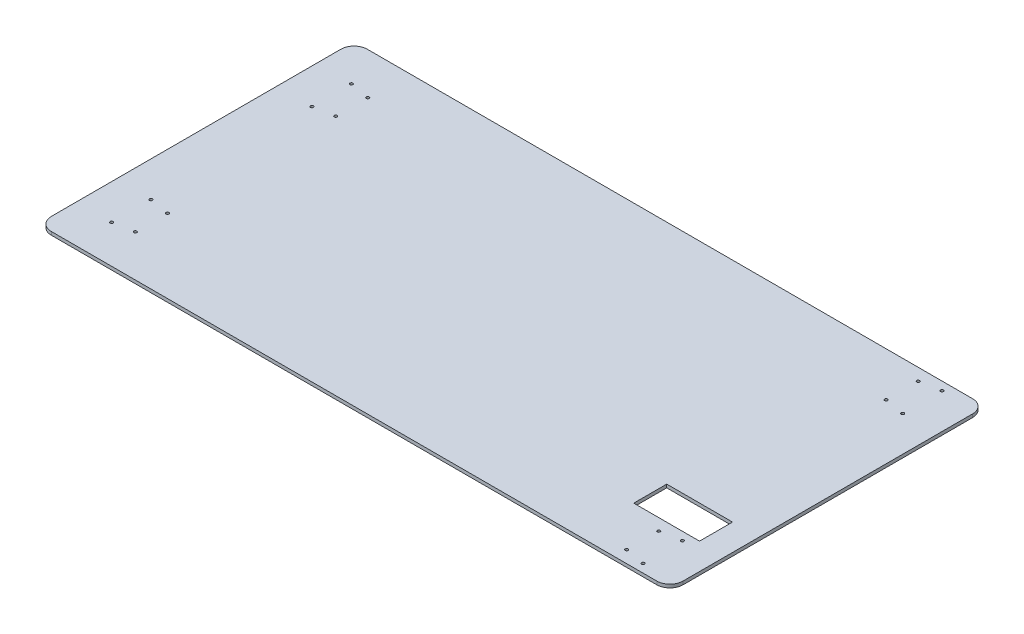
ISO-10303-21;
HEADER;
FILE_DESCRIPTION(('STEP AP214'),'2;1');
FILE_NAME('part.step','',(''),(''),'','','');
FILE_SCHEMA(('AUTOMOTIVE_DESIGN { 1 0 10303 214 1 1 1 1 }'));
ENDSEC;
DATA;
#1=APPLICATION_CONTEXT('core data for automotive mechanical design processes');
#2=APPLICATION_PROTOCOL_DEFINITION('international standard','automotive_design',2000,#1);
#3=PRODUCT_CONTEXT('',#1,'mechanical');
#4=PRODUCT('Part','Part','',(#3));
#5=PRODUCT_RELATED_PRODUCT_CATEGORY('part','',(#4));
#6=PRODUCT_DEFINITION_FORMATION('','',#4);
#7=PRODUCT_DEFINITION_CONTEXT('part definition',#1,'design');
#8=PRODUCT_DEFINITION('design','',#6,#7);
#9=PRODUCT_DEFINITION_SHAPE('','',#8);
#10=(LENGTH_UNIT() NAMED_UNIT(*) SI_UNIT(.MILLI.,.METRE.));
#11=(NAMED_UNIT(*) PLANE_ANGLE_UNIT() SI_UNIT($,.RADIAN.));
#12=(NAMED_UNIT(*) SI_UNIT($,.STERADIAN.) SOLID_ANGLE_UNIT());
#13=UNCERTAINTY_MEASURE_WITH_UNIT(LENGTH_MEASURE(1.E-05),#10,'distance_accuracy_value','');
#14=(GEOMETRIC_REPRESENTATION_CONTEXT(3) GLOBAL_UNCERTAINTY_ASSIGNED_CONTEXT((#13)) GLOBAL_UNIT_ASSIGNED_CONTEXT((#10,
#11,#12)) REPRESENTATION_CONTEXT('',''));
#15=CARTESIAN_POINT('',(0.,0.,0.));
#16=DIRECTION('',(0.,0.,1.));
#17=DIRECTION('',(1.,0.,0.));
#18=AXIS2_PLACEMENT_3D('',#15,#16,#17);
#19=CARTESIAN_POINT('',(0.,6.35,196.85));
#20=DIRECTION('',(0.,0.,1.));
#21=DIRECTION('',(1.,0.,0.));
#22=AXIS2_PLACEMENT_3D('',#19,#20,#21);
#23=PLANE('',#22);
#24=DIRECTION('',(-1.,0.,0.));
#25=VECTOR('',#24,1.);
#26=CARTESIAN_POINT('',(0.,0.,196.85));
#27=LINE('',#26,#25);
#28=CARTESIAN_POINT('',(558.8,0.,196.85));
#29=VERTEX_POINT('',#28);
#30=CARTESIAN_POINT('',(431.8,0.,196.85));
#31=VERTEX_POINT('',#30);
#32=EDGE_CURVE('E160',#29,#31,#27,.T.);
#33=ORIENTED_EDGE('',*,*,#32,.T.);
#34=DIRECTION('',(0.,-1.,0.));
#35=VECTOR('',#34,1.);
#36=CARTESIAN_POINT('',(431.8,6.35,196.85));
#37=LINE('',#36,#35);
#38=CARTESIAN_POINT('',(431.8,6.35,196.85));
#39=VERTEX_POINT('',#38);
#40=EDGE_CURVE('E139',#39,#31,#37,.T.);
#41=ORIENTED_EDGE('',*,*,#40,.F.);
#42=DIRECTION('',(-1.,0.,0.));
#43=VECTOR('',#42,1.);
#44=CARTESIAN_POINT('',(0.,6.35,196.85));
#45=LINE('',#44,#43);
#46=CARTESIAN_POINT('',(558.8,6.35,196.85));
#47=VERTEX_POINT('',#46);
#48=EDGE_CURVE('E147',#47,#39,#45,.T.);
#49=ORIENTED_EDGE('',*,*,#48,.F.);
#50=DIRECTION('',(0.,-1.,0.));
#51=VECTOR('',#50,1.);
#52=CARTESIAN_POINT('',(558.8,6.35,196.85));
#53=LINE('',#52,#51);
#54=EDGE_CURVE('E274',#47,#29,#53,.T.);
#55=ORIENTED_EDGE('',*,*,#54,.T.);
#56=EDGE_LOOP('',(#33,#41,#49,#55));
#57=FACE_BOUND('',#56,.T.);
#58=ADVANCED_FACE('F43',(#57),#23,.F.);
#59=CARTESIAN_POINT('',(431.8,6.35,0.));
#60=DIRECTION('',(-1.,0.,0.));
#61=DIRECTION('',(0.,0.,1.));
#62=AXIS2_PLACEMENT_3D('',#59,#60,#61);
#63=PLANE('',#62);
#64=DIRECTION('',(0.,0.,-1.));
#65=VECTOR('',#64,1.);
#66=CARTESIAN_POINT('',(431.8,0.,0.));
#67=LINE('',#66,#65);
#68=CARTESIAN_POINT('',(431.8,0.,133.155095102418));
#69=VERTEX_POINT('',#68);
#70=EDGE_CURVE('E246',#31,#69,#67,.T.);
#71=ORIENTED_EDGE('',*,*,#70,.T.);
#72=DIRECTION('',(0.,-1.,0.));
#73=VECTOR('',#72,1.);
#74=CARTESIAN_POINT('',(431.8,6.35,133.155095102418));
#75=LINE('',#74,#73);
#76=CARTESIAN_POINT('',(431.8,6.35,133.155095102418));
#77=VERTEX_POINT('',#76);
#78=EDGE_CURVE('E141',#77,#69,#75,.T.);
#79=ORIENTED_EDGE('',*,*,#78,.F.);
#80=DIRECTION('',(0.,0.,-1.));
#81=VECTOR('',#80,1.);
#82=CARTESIAN_POINT('',(431.8,6.35,0.));
#83=LINE('',#82,#81);
#84=EDGE_CURVE('E134',#39,#77,#83,.T.);
#85=ORIENTED_EDGE('',*,*,#84,.F.);
#86=ORIENTED_EDGE('',*,*,#40,.T.);
#87=EDGE_LOOP('',(#71,#79,#85,#86));
#88=FACE_BOUND('',#87,.T.);
#89=ADVANCED_FACE('F137',(#88),#63,.F.);
#90=CARTESIAN_POINT('',(0.,6.35,133.155095102418));
#91=DIRECTION('',(0.,0.,1.));
#92=DIRECTION('',(1.,0.,0.));
#93=AXIS2_PLACEMENT_3D('',#90,#91,#92);
#94=PLANE('',#93);
#95=DIRECTION('',(-1.,0.,0.));
#96=VECTOR('',#95,1.);
#97=CARTESIAN_POINT('',(0.,0.,133.155095102418));
#98=LINE('',#97,#96);
#99=CARTESIAN_POINT('',(558.8,0.,133.155095102418));
#100=VERTEX_POINT('',#99);
#101=EDGE_CURVE('E249',#100,#69,#98,.T.);
#102=ORIENTED_EDGE('',*,*,#101,.F.);
#103=DIRECTION('',(0.,-1.,0.));
#104=VECTOR('',#103,1.);
#105=CARTESIAN_POINT('',(558.8,6.35,133.155095102418));
#106=LINE('',#105,#104);
#107=CARTESIAN_POINT('',(558.8,6.35,133.155095102418));
#108=VERTEX_POINT('',#107);
#109=EDGE_CURVE('E168',#108,#100,#106,.T.);
#110=ORIENTED_EDGE('',*,*,#109,.F.);
#111=DIRECTION('',(-1.,0.,0.));
#112=VECTOR('',#111,1.);
#113=CARTESIAN_POINT('',(0.,6.35,133.155095102418));
#114=LINE('',#113,#112);
#115=EDGE_CURVE('E146',#108,#77,#114,.T.);
#116=ORIENTED_EDGE('',*,*,#115,.T.);
#117=ORIENTED_EDGE('',*,*,#78,.T.);
#118=EDGE_LOOP('',(#102,#110,#116,#117));
#119=FACE_BOUND('',#118,.T.);
#120=ADVANCED_FACE('F283',(#119),#94,.T.);
#121=CARTESIAN_POINT('',(609.6,6.35,0.));
#122=DIRECTION('',(1.,0.,0.));
#123=DIRECTION('',(0.,0.,-1.));
#124=AXIS2_PLACEMENT_3D('',#121,#122,#123);
#125=PLANE('',#124);
#126=DIRECTION('',(0.,0.,1.));
#127=VECTOR('',#126,1.);
#128=CARTESIAN_POINT('',(609.6,6.35,0.));
#129=LINE('',#128,#127);
#130=CARTESIAN_POINT('',(609.6,6.35,-279.4));
#131=VERTEX_POINT('',#130);
#132=CARTESIAN_POINT('',(609.6,6.35,279.4));
#133=VERTEX_POINT('',#132);
#134=EDGE_CURVE('E702',#131,#133,#129,.T.);
#135=ORIENTED_EDGE('',*,*,#134,.T.);
#136=DIRECTION('',(0.,-1.,0.));
#137=VECTOR('',#136,1.);
#138=CARTESIAN_POINT('',(609.6,0.,279.4));
#139=LINE('',#138,#137);
#140=CARTESIAN_POINT('',(609.6,0.,279.4));
#141=VERTEX_POINT('',#140);
#142=EDGE_CURVE('E166',#133,#141,#139,.T.);
#143=ORIENTED_EDGE('',*,*,#142,.T.);
#144=DIRECTION('',(0.,0.,1.));
#145=VECTOR('',#144,1.);
#146=CARTESIAN_POINT('',(609.6,0.,0.));
#147=LINE('',#146,#145);
#148=CARTESIAN_POINT('',(609.6,0.,-279.4));
#149=VERTEX_POINT('',#148);
#150=EDGE_CURVE('E231',#149,#141,#147,.T.);
#151=ORIENTED_EDGE('',*,*,#150,.F.);
#152=DIRECTION('',(0.,-1.,0.));
#153=VECTOR('',#152,1.);
#154=CARTESIAN_POINT('',(609.6,6.35,-279.4));
#155=LINE('',#154,#153);
#156=EDGE_CURVE('E162',#149,#131,#155,.F.);
#157=ORIENTED_EDGE('',*,*,#156,.T.);
#158=EDGE_LOOP('',(#135,#143,#151,#157));
#159=FACE_BOUND('',#158,.T.);
#160=ADVANCED_FACE('F332',(#159),#125,.T.);
#161=CARTESIAN_POINT('',(0.,6.35,-304.8));
#162=DIRECTION('',(0.,0.,-1.));
#163=DIRECTION('',(-1.,0.,0.));
#164=AXIS2_PLACEMENT_3D('',#161,#162,#163);
#165=PLANE('',#164);
#166=DIRECTION('',(1.,0.,0.));
#167=VECTOR('',#166,1.);
#168=CARTESIAN_POINT('',(0.,6.35,-304.8));
#169=LINE('',#168,#167);
#170=CARTESIAN_POINT('',(-584.2,6.35,-304.8));
#171=VERTEX_POINT('',#170);
#172=CARTESIAN_POINT('',(584.2,6.35,-304.8));
#173=VERTEX_POINT('',#172);
#174=EDGE_CURVE('E220',#171,#173,#169,.T.);
#175=ORIENTED_EDGE('',*,*,#174,.T.);
#176=DIRECTION('',(0.,-1.,0.));
#177=VECTOR('',#176,1.);
#178=CARTESIAN_POINT('',(584.2,6.35,-304.8));
#179=LINE('',#178,#177);
#180=CARTESIAN_POINT('',(584.2,0.,-304.8));
#181=VERTEX_POINT('',#180);
#182=EDGE_CURVE('E208',#173,#181,#179,.T.);
#183=ORIENTED_EDGE('',*,*,#182,.T.);
#184=DIRECTION('',(1.,0.,0.));
#185=VECTOR('',#184,1.);
#186=CARTESIAN_POINT('',(0.,0.,-304.8));
#187=LINE('',#186,#185);
#188=CARTESIAN_POINT('',(-584.2,0.,-304.8));
#189=VERTEX_POINT('',#188);
#190=EDGE_CURVE('E218',#189,#181,#187,.T.);
#191=ORIENTED_EDGE('',*,*,#190,.F.);
#192=DIRECTION('',(0.,-1.,0.));
#193=VECTOR('',#192,1.);
#194=CARTESIAN_POINT('',(-584.2,6.35,-304.8));
#195=LINE('',#194,#193);
#196=EDGE_CURVE('E205',#189,#171,#195,.F.);
#197=ORIENTED_EDGE('',*,*,#196,.T.);
#198=EDGE_LOOP('',(#175,#183,#191,#197));
#199=FACE_BOUND('',#198,.T.);
#200=ADVANCED_FACE('F217',(#199),#165,.T.);
#201=CARTESIAN_POINT('',(-609.6,6.35,0.));
#202=DIRECTION('',(1.,0.,0.));
#203=DIRECTION('',(0.,0.,-1.));
#204=AXIS2_PLACEMENT_3D('',#201,#202,#203);
#205=PLANE('',#204);
#206=DIRECTION('',(0.,0.,1.));
#207=VECTOR('',#206,1.);
#208=CARTESIAN_POINT('',(-609.6,6.35,0.));
#209=LINE('',#208,#207);
#210=CARTESIAN_POINT('',(-609.6,6.35,-279.4));
#211=VERTEX_POINT('',#210);
#212=CARTESIAN_POINT('',(-609.6,6.35,279.4));
#213=VERTEX_POINT('',#212);
#214=EDGE_CURVE('E391',#211,#213,#209,.T.);
#215=ORIENTED_EDGE('',*,*,#214,.F.);
#216=DIRECTION('',(0.,-1.,0.));
#217=VECTOR('',#216,1.);
#218=CARTESIAN_POINT('',(-609.6,0.,-279.4));
#219=LINE('',#218,#217);
#220=CARTESIAN_POINT('',(-609.6,0.,-279.4));
#221=VERTEX_POINT('',#220);
#222=EDGE_CURVE('E11',#211,#221,#219,.T.);
#223=ORIENTED_EDGE('',*,*,#222,.T.);
#224=DIRECTION('',(0.,0.,1.));
#225=VECTOR('',#224,1.);
#226=CARTESIAN_POINT('',(-609.6,0.,0.));
#227=LINE('',#226,#225);
#228=CARTESIAN_POINT('',(-609.6,0.,279.4));
#229=VERTEX_POINT('',#228);
#230=EDGE_CURVE('E230',#221,#229,#227,.T.);
#231=ORIENTED_EDGE('',*,*,#230,.T.);
#232=DIRECTION('',(0.,-1.,0.));
#233=VECTOR('',#232,1.);
#234=CARTESIAN_POINT('',(-609.6,6.35,279.4));
#235=LINE('',#234,#233);
#236=EDGE_CURVE('E52',#229,#213,#235,.F.);
#237=ORIENTED_EDGE('',*,*,#236,.T.);
#238=EDGE_LOOP('',(#215,#223,#231,#237));
#239=FACE_BOUND('',#238,.T.);
#240=ADVANCED_FACE('F326',(#239),#205,.F.);
#241=CARTESIAN_POINT('',(-541.528,6.35,231.394));
#242=DIRECTION('',(0.,-1.,0.));
#243=DIRECTION('',(0.,0.,-1.));
#244=AXIS2_PLACEMENT_3D('',#241,#242,#243);
#245=CYLINDRICAL_SURFACE('',#244,2.7940000000001);
#246=CARTESIAN_POINT('',(-541.528,6.35,231.394));
#247=DIRECTION('',(0.,1.,0.));
#248=DIRECTION('',(0.,0.,1.));
#249=AXIS2_PLACEMENT_3D('',#246,#247,#248);
#250=CIRCLE('',#249,2.7940000000001);
#251=CARTESIAN_POINT('',(-541.528,6.35,234.188));
#252=VERTEX_POINT('',#251);
#253=EDGE_CURVE('E417',#252,#252,#250,.F.);
#254=ORIENTED_EDGE('',*,*,#253,.F.);
#255=EDGE_LOOP('',(#254));
#256=FACE_BOUND('',#255,.T.);
#257=CARTESIAN_POINT('',(-541.528,0.,231.394));
#258=DIRECTION('',(0.,1.,0.));
#259=DIRECTION('',(0.,0.,1.));
#260=AXIS2_PLACEMENT_3D('',#257,#258,#259);
#261=CIRCLE('',#260,2.7940000000001);
#262=CARTESIAN_POINT('',(-541.528,0.,234.188));
#263=VERTEX_POINT('',#262);
#264=EDGE_CURVE('E265',#263,#263,#261,.F.);
#265=ORIENTED_EDGE('',*,*,#264,.T.);
#266=EDGE_LOOP('',(#265));
#267=FACE_BOUND('',#266,.T.);
#268=ADVANCED_FACE('F329',(#256,#267),#245,.F.);
#269=CARTESIAN_POINT('',(541.528,6.35,288.544));
#270=DIRECTION('',(0.,-1.,0.));
#271=DIRECTION('',(0.,0.,-1.));
#272=AXIS2_PLACEMENT_3D('',#269,#270,#271);
#273=CYLINDRICAL_SURFACE('',#272,2.79400000000009);
#274=CARTESIAN_POINT('',(541.528,6.35,288.544));
#275=DIRECTION('',(0.,1.,0.));
#276=DIRECTION('',(0.,0.,1.));
#277=AXIS2_PLACEMENT_3D('',#274,#275,#276);
#278=CIRCLE('',#277,2.79400000000009);
#279=CARTESIAN_POINT('',(541.528,6.35,291.338));
#280=VERTEX_POINT('',#279);
#281=EDGE_CURVE('E413',#280,#280,#278,.F.);
#282=ORIENTED_EDGE('',*,*,#281,.F.);
#283=EDGE_LOOP('',(#282));
#284=FACE_BOUND('',#283,.T.);
#285=CARTESIAN_POINT('',(541.528,0.,288.544));
#286=DIRECTION('',(0.,1.,0.));
#287=DIRECTION('',(0.,0.,1.));
#288=AXIS2_PLACEMENT_3D('',#285,#286,#287);
#289=CIRCLE('',#288,2.79400000000009);
#290=CARTESIAN_POINT('',(541.528,0.,291.338));
#291=VERTEX_POINT('',#290);
#292=EDGE_CURVE('E261',#291,#291,#289,.F.);
#293=ORIENTED_EDGE('',*,*,#292,.T.);
#294=EDGE_LOOP('',(#293));
#295=FACE_BOUND('',#294,.T.);
#296=ADVANCED_FACE('F510',(#284,#295),#273,.F.);
#297=CARTESIAN_POINT('',(502.666,6.35,219.456));
#298=DIRECTION('',(0.,-1.,0.));
#299=DIRECTION('',(0.,0.,-1.));
#300=AXIS2_PLACEMENT_3D('',#297,#298,#299);
#301=CYLINDRICAL_SURFACE('',#300,2.7940000000001);
#302=CARTESIAN_POINT('',(502.666,6.35,219.456));
#303=DIRECTION('',(0.,1.,0.));
#304=DIRECTION('',(0.,0.,1.));
#305=AXIS2_PLACEMENT_3D('',#302,#303,#304);
#306=CIRCLE('',#305,2.7940000000001);
#307=CARTESIAN_POINT('',(502.666,6.35,222.25));
#308=VERTEX_POINT('',#307);
#309=EDGE_CURVE('E409',#308,#308,#306,.F.);
#310=ORIENTED_EDGE('',*,*,#309,.F.);
#311=EDGE_LOOP('',(#310));
#312=FACE_BOUND('',#311,.T.);
#313=CARTESIAN_POINT('',(502.666,0.,219.456));
#314=DIRECTION('',(0.,1.,0.));
#315=DIRECTION('',(0.,0.,1.));
#316=AXIS2_PLACEMENT_3D('',#313,#314,#315);
#317=CIRCLE('',#316,2.7940000000001);
#318=CARTESIAN_POINT('',(502.666,0.,222.25));
#319=VERTEX_POINT('',#318);
#320=EDGE_CURVE('E257',#319,#319,#317,.F.);
#321=ORIENTED_EDGE('',*,*,#320,.T.);
#322=EDGE_LOOP('',(#321));
#323=FACE_BOUND('',#322,.T.);
#324=ADVANCED_FACE('F514',(#312,#323),#301,.F.);
#325=CARTESIAN_POINT('',(558.8,6.35,-9.74006676292393E-13));
#326=DIRECTION('',(-1.,0.,0.));
#327=DIRECTION('',(0.,0.,1.));
#328=AXIS2_PLACEMENT_3D('',#325,#326,#327);
#329=PLANE('',#328);
#330=DIRECTION('',(0.,0.,-1.));
#331=VECTOR('',#330,1.);
#332=CARTESIAN_POINT('',(558.8,0.,-9.74006676292393E-13));
#333=LINE('',#332,#331);
#334=EDGE_CURVE('E253',#29,#100,#333,.T.);
#335=ORIENTED_EDGE('',*,*,#334,.F.);
#336=ORIENTED_EDGE('',*,*,#54,.F.);
#337=DIRECTION('',(0.,0.,-1.));
#338=VECTOR('',#337,1.);
#339=CARTESIAN_POINT('',(558.8,6.35,-9.74006676292393E-13));
#340=LINE('',#339,#338);
#341=EDGE_CURVE('E154',#47,#108,#340,.T.);
#342=ORIENTED_EDGE('',*,*,#341,.T.);
#343=ORIENTED_EDGE('',*,*,#109,.T.);
#344=EDGE_LOOP('',(#335,#336,#342,#343));
#345=FACE_BOUND('',#344,.T.);
#346=ADVANCED_FACE('F281',(#345),#329,.T.);
#347=CARTESIAN_POINT('',(0.,6.35,304.8));
#348=DIRECTION('',(0.,0.,-1.));
#349=DIRECTION('',(-1.,0.,0.));
#350=AXIS2_PLACEMENT_3D('',#347,#348,#349);
#351=PLANE('',#350);
#352=DIRECTION('',(1.,0.,0.));
#353=VECTOR('',#352,1.);
#354=CARTESIAN_POINT('',(0.,0.,304.8));
#355=LINE('',#354,#353);
#356=CARTESIAN_POINT('',(-584.2,0.,304.8));
#357=VERTEX_POINT('',#356);
#358=CARTESIAN_POINT('',(584.2,0.,304.8));
#359=VERTEX_POINT('',#358);
#360=EDGE_CURVE('E235',#357,#359,#355,.T.);
#361=ORIENTED_EDGE('',*,*,#360,.T.);
#362=DIRECTION('',(0.,-1.,0.));
#363=VECTOR('',#362,1.);
#364=CARTESIAN_POINT('',(584.2,6.35,304.8));
#365=LINE('',#364,#363);
#366=CARTESIAN_POINT('',(584.2,6.35,304.8));
#367=VERTEX_POINT('',#366);
#368=EDGE_CURVE('E191',#359,#367,#365,.F.);
#369=ORIENTED_EDGE('',*,*,#368,.T.);
#370=DIRECTION('',(1.,0.,0.));
#371=VECTOR('',#370,1.);
#372=CARTESIAN_POINT('',(0.,6.35,304.8));
#373=LINE('',#372,#371);
#374=CARTESIAN_POINT('',(-584.2,6.35,304.8));
#375=VERTEX_POINT('',#374);
#376=EDGE_CURVE('E157',#375,#367,#373,.T.);
#377=ORIENTED_EDGE('',*,*,#376,.F.);
#378=DIRECTION('',(0.,-1.,0.));
#379=VECTOR('',#378,1.);
#380=CARTESIAN_POINT('',(-584.2,6.35,304.8));
#381=LINE('',#380,#379);
#382=EDGE_CURVE('E187',#375,#357,#381,.T.);
#383=ORIENTED_EDGE('',*,*,#382,.T.);
#384=EDGE_LOOP('',(#361,#369,#377,#383));
#385=FACE_BOUND('',#384,.T.);
#386=ADVANCED_FACE('F321',(#385),#351,.F.);
#387=CARTESIAN_POINT('',(541.528,6.35,-288.544));
#388=DIRECTION('',(0.,-1.,0.));
#389=DIRECTION('',(0.,0.,-1.));
#390=AXIS2_PLACEMENT_3D('',#387,#388,#389);
#391=CYLINDRICAL_SURFACE('',#390,2.79400000000009);
#392=CARTESIAN_POINT('',(541.528,6.35,-288.544));
#393=DIRECTION('',(0.,1.,0.));
#394=DIRECTION('',(0.,0.,1.));
#395=AXIS2_PLACEMENT_3D('',#392,#393,#394);
#396=CIRCLE('',#395,2.79400000000009);
#397=CARTESIAN_POINT('',(541.528,6.35,-285.75));
#398=VERTEX_POINT('',#397);
#399=EDGE_CURVE('E706',#398,#398,#396,.T.);
#400=ORIENTED_EDGE('',*,*,#399,.T.);
#401=EDGE_LOOP('',(#400));
#402=FACE_BOUND('',#401,.T.);
#403=CARTESIAN_POINT('',(541.528,0.,-288.544));
#404=DIRECTION('',(0.,1.,0.));
#405=DIRECTION('',(0.,0.,1.));
#406=AXIS2_PLACEMENT_3D('',#403,#404,#405);
#407=CIRCLE('',#406,2.79400000000009);
#408=CARTESIAN_POINT('',(541.528,0.,-285.75));
#409=VERTEX_POINT('',#408);
#410=EDGE_CURVE('E237',#409,#409,#407,.T.);
#411=ORIENTED_EDGE('',*,*,#410,.F.);
#412=EDGE_LOOP('',(#411));
#413=FACE_BOUND('',#412,.T.);
#414=ADVANCED_FACE('F324',(#402,#413),#391,.F.);
#415=CARTESIAN_POINT('',(541.528,6.35,-212.598));
#416=DIRECTION('',(0.,-1.,0.));
#417=DIRECTION('',(0.,0.,-1.));
#418=AXIS2_PLACEMENT_3D('',#415,#416,#417);
#419=CYLINDRICAL_SURFACE('',#418,2.7940000000001);
#420=CARTESIAN_POINT('',(541.528,6.35,-212.598));
#421=DIRECTION('',(0.,1.,0.));
#422=DIRECTION('',(0.,0.,1.));
#423=AXIS2_PLACEMENT_3D('',#420,#421,#422);
#424=CIRCLE('',#423,2.7940000000001);
#425=CARTESIAN_POINT('',(541.528,6.35,-209.804));
#426=VERTEX_POINT('',#425);
#427=EDGE_CURVE('E710',#426,#426,#424,.T.);
#428=ORIENTED_EDGE('',*,*,#427,.T.);
#429=EDGE_LOOP('',(#428));
#430=FACE_BOUND('',#429,.T.);
#431=CARTESIAN_POINT('',(541.528,0.,-212.598));
#432=DIRECTION('',(0.,1.,0.));
#433=DIRECTION('',(0.,0.,1.));
#434=AXIS2_PLACEMENT_3D('',#431,#432,#433);
#435=CIRCLE('',#434,2.7940000000001);
#436=CARTESIAN_POINT('',(541.528,0.,-209.804));
#437=VERTEX_POINT('',#436);
#438=EDGE_CURVE('E464',#437,#437,#435,.T.);
#439=ORIENTED_EDGE('',*,*,#438,.F.);
#440=EDGE_LOOP('',(#439));
#441=FACE_BOUND('',#440,.T.);
#442=ADVANCED_FACE('F338',(#430,#441),#419,.F.);
#443=CARTESIAN_POINT('',(502.666,6.35,-219.456));
#444=DIRECTION('',(0.,-1.,0.));
#445=DIRECTION('',(0.,0.,-1.));
#446=AXIS2_PLACEMENT_3D('',#443,#444,#445);
#447=CYLINDRICAL_SURFACE('',#446,2.7940000000001);
#448=CARTESIAN_POINT('',(502.666,6.35,-219.456));
#449=DIRECTION('',(0.,1.,0.));
#450=DIRECTION('',(0.,0.,1.));
#451=AXIS2_PLACEMENT_3D('',#448,#449,#450);
#452=CIRCLE('',#451,2.7940000000001);
#453=CARTESIAN_POINT('',(502.666,6.35,-216.662));
#454=VERTEX_POINT('',#453);
#455=EDGE_CURVE('E714',#454,#454,#452,.T.);
#456=ORIENTED_EDGE('',*,*,#455,.T.);
#457=EDGE_LOOP('',(#456));
#458=FACE_BOUND('',#457,.T.);
#459=CARTESIAN_POINT('',(502.666,0.,-219.456));
#460=DIRECTION('',(0.,1.,0.));
#461=DIRECTION('',(0.,0.,1.));
#462=AXIS2_PLACEMENT_3D('',#459,#460,#461);
#463=CIRCLE('',#462,2.7940000000001);
#464=CARTESIAN_POINT('',(502.666,0.,-216.662));
#465=VERTEX_POINT('',#464);
#466=EDGE_CURVE('E460',#465,#465,#463,.T.);
#467=ORIENTED_EDGE('',*,*,#466,.F.);
#468=EDGE_LOOP('',(#467));
#469=FACE_BOUND('',#468,.T.);
#470=ADVANCED_FACE('F342',(#458,#469),#447,.F.);
#471=CARTESIAN_POINT('',(502.666,6.35,-281.432));
#472=DIRECTION('',(0.,-1.,0.));
#473=DIRECTION('',(0.,0.,-1.));
#474=AXIS2_PLACEMENT_3D('',#471,#472,#473);
#475=CYLINDRICAL_SURFACE('',#474,2.79400000000009);
#476=CARTESIAN_POINT('',(502.666,6.35,-281.432));
#477=DIRECTION('',(0.,1.,0.));
#478=DIRECTION('',(0.,0.,1.));
#479=AXIS2_PLACEMENT_3D('',#476,#477,#478);
#480=CIRCLE('',#479,2.79400000000009);
#481=CARTESIAN_POINT('',(502.666,6.35,-278.638));
#482=VERTEX_POINT('',#481);
#483=EDGE_CURVE('E718',#482,#482,#480,.T.);
#484=ORIENTED_EDGE('',*,*,#483,.T.);
#485=EDGE_LOOP('',(#484));
#486=FACE_BOUND('',#485,.T.);
#487=CARTESIAN_POINT('',(502.666,0.,-281.432));
#488=DIRECTION('',(0.,1.,0.));
#489=DIRECTION('',(0.,0.,1.));
#490=AXIS2_PLACEMENT_3D('',#487,#488,#489);
#491=CIRCLE('',#490,2.79400000000009);
#492=CARTESIAN_POINT('',(502.666,0.,-278.638));
#493=VERTEX_POINT('',#492);
#494=EDGE_CURVE('E456',#493,#493,#491,.T.);
#495=ORIENTED_EDGE('',*,*,#494,.F.);
#496=EDGE_LOOP('',(#495));
#497=FACE_BOUND('',#496,.T.);
#498=ADVANCED_FACE('F346',(#486,#497),#475,.F.);
#499=CARTESIAN_POINT('',(502.666,6.35,281.432));
#500=DIRECTION('',(0.,-1.,0.));
#501=DIRECTION('',(0.,0.,-1.));
#502=AXIS2_PLACEMENT_3D('',#499,#500,#501);
#503=CYLINDRICAL_SURFACE('',#502,2.79400000000009);
#504=CARTESIAN_POINT('',(502.666,6.35,281.432));
#505=DIRECTION('',(0.,1.,0.));
#506=DIRECTION('',(0.,0.,1.));
#507=AXIS2_PLACEMENT_3D('',#504,#505,#506);
#508=CIRCLE('',#507,2.79400000000009);
#509=CARTESIAN_POINT('',(502.666,6.35,284.226));
#510=VERTEX_POINT('',#509);
#511=EDGE_CURVE('E722',#510,#510,#508,.F.);
#512=ORIENTED_EDGE('',*,*,#511,.F.);
#513=EDGE_LOOP('',(#512));
#514=FACE_BOUND('',#513,.T.);
#515=CARTESIAN_POINT('',(502.666,0.,281.432));
#516=DIRECTION('',(0.,1.,0.));
#517=DIRECTION('',(0.,0.,1.));
#518=AXIS2_PLACEMENT_3D('',#515,#516,#517);
#519=CIRCLE('',#518,2.79400000000009);
#520=CARTESIAN_POINT('',(502.666,0.,284.226));
#521=VERTEX_POINT('',#520);
#522=EDGE_CURVE('E452',#521,#521,#519,.F.);
#523=ORIENTED_EDGE('',*,*,#522,.T.);
#524=EDGE_LOOP('',(#523));
#525=FACE_BOUND('',#524,.T.);
#526=ADVANCED_FACE('F350',(#514,#525),#503,.F.);
#527=CARTESIAN_POINT('',(541.528,6.35,212.598));
#528=DIRECTION('',(0.,-1.,0.));
#529=DIRECTION('',(0.,0.,-1.));
#530=AXIS2_PLACEMENT_3D('',#527,#528,#529);
#531=CYLINDRICAL_SURFACE('',#530,2.7940000000001);
#532=CARTESIAN_POINT('',(541.528,6.35,212.598));
#533=DIRECTION('',(0.,1.,0.));
#534=DIRECTION('',(0.,0.,1.));
#535=AXIS2_PLACEMENT_3D('',#532,#533,#534);
#536=CIRCLE('',#535,2.7940000000001);
#537=CARTESIAN_POINT('',(541.528,6.35,215.392));
#538=VERTEX_POINT('',#537);
#539=EDGE_CURVE('E726',#538,#538,#536,.F.);
#540=ORIENTED_EDGE('',*,*,#539,.F.);
#541=EDGE_LOOP('',(#540));
#542=FACE_BOUND('',#541,.T.);
#543=CARTESIAN_POINT('',(541.528,0.,212.598));
#544=DIRECTION('',(0.,1.,0.));
#545=DIRECTION('',(0.,0.,1.));
#546=AXIS2_PLACEMENT_3D('',#543,#544,#545);
#547=CIRCLE('',#546,2.7940000000001);
#548=CARTESIAN_POINT('',(541.528,0.,215.392));
#549=VERTEX_POINT('',#548);
#550=EDGE_CURVE('E448',#549,#549,#547,.F.);
#551=ORIENTED_EDGE('',*,*,#550,.T.);
#552=EDGE_LOOP('',(#551));
#553=FACE_BOUND('',#552,.T.);
#554=ADVANCED_FACE('F354',(#542,#553),#531,.F.);
#555=CARTESIAN_POINT('',(-541.528,6.35,-155.448));
#556=DIRECTION('',(0.,-1.,0.));
#557=DIRECTION('',(0.,0.,-1.));
#558=AXIS2_PLACEMENT_3D('',#555,#556,#557);
#559=CYLINDRICAL_SURFACE('',#558,2.79399999999998);
#560=CARTESIAN_POINT('',(-541.528,6.35,-155.448));
#561=DIRECTION('',(0.,1.,0.));
#562=DIRECTION('',(0.,0.,1.));
#563=AXIS2_PLACEMENT_3D('',#560,#561,#562);
#564=CIRCLE('',#563,2.79399999999998);
#565=CARTESIAN_POINT('',(-541.528,6.35,-152.654));
#566=VERTEX_POINT('',#565);
#567=EDGE_CURVE('E730',#566,#566,#564,.T.);
#568=ORIENTED_EDGE('',*,*,#567,.T.);
#569=EDGE_LOOP('',(#568));
#570=FACE_BOUND('',#569,.T.);
#571=CARTESIAN_POINT('',(-541.528,0.,-155.448));
#572=DIRECTION('',(0.,1.,0.));
#573=DIRECTION('',(0.,0.,1.));
#574=AXIS2_PLACEMENT_3D('',#571,#572,#573);
#575=CIRCLE('',#574,2.79399999999998);
#576=CARTESIAN_POINT('',(-541.528,0.,-152.654));
#577=VERTEX_POINT('',#576);
#578=EDGE_CURVE('E444',#577,#577,#575,.T.);
#579=ORIENTED_EDGE('',*,*,#578,.F.);
#580=EDGE_LOOP('',(#579));
#581=FACE_BOUND('',#580,.T.);
#582=ADVANCED_FACE('F358',(#570,#581),#559,.F.);
#583=CARTESIAN_POINT('',(-502.666,6.35,-224.282));
#584=DIRECTION('',(0.,-1.,0.));
#585=DIRECTION('',(0.,0.,-1.));
#586=AXIS2_PLACEMENT_3D('',#583,#584,#585);
#587=CYLINDRICAL_SURFACE('',#586,2.79400000000004);
#588=CARTESIAN_POINT('',(-502.666,6.35,-224.282));
#589=DIRECTION('',(0.,1.,0.));
#590=DIRECTION('',(0.,0.,1.));
#591=AXIS2_PLACEMENT_3D('',#588,#589,#590);
#592=CIRCLE('',#591,2.79400000000004);
#593=CARTESIAN_POINT('',(-502.666,6.35,-221.488));
#594=VERTEX_POINT('',#593);
#595=EDGE_CURVE('E734',#594,#594,#592,.T.);
#596=ORIENTED_EDGE('',*,*,#595,.T.);
#597=EDGE_LOOP('',(#596));
#598=FACE_BOUND('',#597,.T.);
#599=CARTESIAN_POINT('',(-502.666,0.,-224.282));
#600=DIRECTION('',(0.,1.,0.));
#601=DIRECTION('',(0.,0.,1.));
#602=AXIS2_PLACEMENT_3D('',#599,#600,#601);
#603=CIRCLE('',#602,2.79400000000004);
#604=CARTESIAN_POINT('',(-502.666,0.,-221.488));
#605=VERTEX_POINT('',#604);
#606=EDGE_CURVE('E440',#605,#605,#603,.T.);
#607=ORIENTED_EDGE('',*,*,#606,.F.);
#608=EDGE_LOOP('',(#607));
#609=FACE_BOUND('',#608,.T.);
#610=ADVANCED_FACE('F362',(#598,#609),#587,.F.);
#611=CARTESIAN_POINT('',(-541.528,6.35,-231.394));
#612=DIRECTION('',(0.,-1.,0.));
#613=DIRECTION('',(0.,0.,-1.));
#614=AXIS2_PLACEMENT_3D('',#611,#612,#613);
#615=CYLINDRICAL_SURFACE('',#614,2.7940000000001);
#616=CARTESIAN_POINT('',(-541.528,6.35,-231.394));
#617=DIRECTION('',(0.,1.,0.));
#618=DIRECTION('',(0.,0.,1.));
#619=AXIS2_PLACEMENT_3D('',#616,#617,#618);
#620=CIRCLE('',#619,2.7940000000001);
#621=CARTESIAN_POINT('',(-541.528,6.35,-228.6));
#622=VERTEX_POINT('',#621);
#623=EDGE_CURVE('E738',#622,#622,#620,.T.);
#624=ORIENTED_EDGE('',*,*,#623,.T.);
#625=EDGE_LOOP('',(#624));
#626=FACE_BOUND('',#625,.T.);
#627=CARTESIAN_POINT('',(-541.528,0.,-231.394));
#628=DIRECTION('',(0.,1.,0.));
#629=DIRECTION('',(0.,0.,1.));
#630=AXIS2_PLACEMENT_3D('',#627,#628,#629);
#631=CIRCLE('',#630,2.7940000000001);
#632=CARTESIAN_POINT('',(-541.528,0.,-228.6));
#633=VERTEX_POINT('',#632);
#634=EDGE_CURVE('E436',#633,#633,#631,.T.);
#635=ORIENTED_EDGE('',*,*,#634,.F.);
#636=EDGE_LOOP('',(#635));
#637=FACE_BOUND('',#636,.T.);
#638=ADVANCED_FACE('F366',(#626,#637),#615,.F.);
#639=CARTESIAN_POINT('',(-502.666,6.35,-162.306));
#640=DIRECTION('',(0.,-1.,0.));
#641=DIRECTION('',(0.,0.,-1.));
#642=AXIS2_PLACEMENT_3D('',#639,#640,#641);
#643=CYLINDRICAL_SURFACE('',#642,2.79400000000004);
#644=CARTESIAN_POINT('',(-502.666,6.35,-162.306));
#645=DIRECTION('',(0.,1.,0.));
#646=DIRECTION('',(0.,0.,1.));
#647=AXIS2_PLACEMENT_3D('',#644,#645,#646);
#648=CIRCLE('',#647,2.79400000000004);
#649=CARTESIAN_POINT('',(-502.666,6.35,-159.512));
#650=VERTEX_POINT('',#649);
#651=EDGE_CURVE('E742',#650,#650,#648,.T.);
#652=ORIENTED_EDGE('',*,*,#651,.T.);
#653=EDGE_LOOP('',(#652));
#654=FACE_BOUND('',#653,.T.);
#655=CARTESIAN_POINT('',(-502.666,0.,-162.306));
#656=DIRECTION('',(0.,1.,0.));
#657=DIRECTION('',(0.,0.,1.));
#658=AXIS2_PLACEMENT_3D('',#655,#656,#657);
#659=CIRCLE('',#658,2.79400000000004);
#660=CARTESIAN_POINT('',(-502.666,0.,-159.512));
#661=VERTEX_POINT('',#660);
#662=EDGE_CURVE('E432',#661,#661,#659,.T.);
#663=ORIENTED_EDGE('',*,*,#662,.F.);
#664=EDGE_LOOP('',(#663));
#665=FACE_BOUND('',#664,.T.);
#666=ADVANCED_FACE('F370',(#654,#665),#643,.F.);
#667=CARTESIAN_POINT('',(-502.666,6.35,162.306));
#668=DIRECTION('',(0.,-1.,0.));
#669=DIRECTION('',(0.,0.,-1.));
#670=AXIS2_PLACEMENT_3D('',#667,#668,#669);
#671=CYLINDRICAL_SURFACE('',#670,2.79400000000004);
#672=CARTESIAN_POINT('',(-502.666,6.35,162.306));
#673=DIRECTION('',(0.,1.,0.));
#674=DIRECTION('',(0.,0.,1.));
#675=AXIS2_PLACEMENT_3D('',#672,#673,#674);
#676=CIRCLE('',#675,2.79400000000004);
#677=CARTESIAN_POINT('',(-502.666,6.35,165.1));
#678=VERTEX_POINT('',#677);
#679=EDGE_CURVE('E746',#678,#678,#676,.F.);
#680=ORIENTED_EDGE('',*,*,#679,.F.);
#681=EDGE_LOOP('',(#680));
#682=FACE_BOUND('',#681,.T.);
#683=CARTESIAN_POINT('',(-502.666,0.,162.306));
#684=DIRECTION('',(0.,1.,0.));
#685=DIRECTION('',(0.,0.,1.));
#686=AXIS2_PLACEMENT_3D('',#683,#684,#685);
#687=CIRCLE('',#686,2.79400000000004);
#688=CARTESIAN_POINT('',(-502.666,0.,165.1));
#689=VERTEX_POINT('',#688);
#690=EDGE_CURVE('E428',#689,#689,#687,.F.);
#691=ORIENTED_EDGE('',*,*,#690,.T.);
#692=EDGE_LOOP('',(#691));
#693=FACE_BOUND('',#692,.T.);
#694=ADVANCED_FACE('F308',(#682,#693),#671,.F.);
#695=CARTESIAN_POINT('',(-502.666,6.35,224.282));
#696=DIRECTION('',(0.,-1.,0.));
#697=DIRECTION('',(0.,0.,-1.));
#698=AXIS2_PLACEMENT_3D('',#695,#696,#697);
#699=CYLINDRICAL_SURFACE('',#698,2.79400000000004);
#700=CARTESIAN_POINT('',(-502.666,6.35,224.282));
#701=DIRECTION('',(0.,1.,0.));
#702=DIRECTION('',(0.,0.,1.));
#703=AXIS2_PLACEMENT_3D('',#700,#701,#702);
#704=CIRCLE('',#703,2.79400000000004);
#705=CARTESIAN_POINT('',(-502.666,6.35,227.076));
#706=VERTEX_POINT('',#705);
#707=EDGE_CURVE('E273',#706,#706,#704,.F.);
#708=ORIENTED_EDGE('',*,*,#707,.F.);
#709=EDGE_LOOP('',(#708));
#710=FACE_BOUND('',#709,.T.);
#711=CARTESIAN_POINT('',(-502.666,0.,224.282));
#712=DIRECTION('',(0.,1.,0.));
#713=DIRECTION('',(0.,0.,1.));
#714=AXIS2_PLACEMENT_3D('',#711,#712,#713);
#715=CIRCLE('',#714,2.79400000000004);
#716=CARTESIAN_POINT('',(-502.666,0.,227.076));
#717=VERTEX_POINT('',#716);
#718=EDGE_CURVE('E424',#717,#717,#715,.F.);
#719=ORIENTED_EDGE('',*,*,#718,.T.);
#720=EDGE_LOOP('',(#719));
#721=FACE_BOUND('',#720,.T.);
#722=ADVANCED_FACE('F299',(#710,#721),#699,.F.);
#723=CARTESIAN_POINT('',(-541.528,6.35,155.448));
#724=DIRECTION('',(0.,-1.,0.));
#725=DIRECTION('',(0.,0.,-1.));
#726=AXIS2_PLACEMENT_3D('',#723,#724,#725);
#727=CYLINDRICAL_SURFACE('',#726,2.79399999999998);
#728=CARTESIAN_POINT('',(-541.528,6.35,155.448));
#729=DIRECTION('',(0.,1.,0.));
#730=DIRECTION('',(0.,0.,1.));
#731=AXIS2_PLACEMENT_3D('',#728,#729,#730);
#732=CIRCLE('',#731,2.79399999999998);
#733=CARTESIAN_POINT('',(-541.528,6.35,158.242));
#734=VERTEX_POINT('',#733);
#735=EDGE_CURVE('E276',#734,#734,#732,.F.);
#736=ORIENTED_EDGE('',*,*,#735,.F.);
#737=EDGE_LOOP('',(#736));
#738=FACE_BOUND('',#737,.T.);
#739=CARTESIAN_POINT('',(-541.528,0.,155.448));
#740=DIRECTION('',(0.,1.,0.));
#741=DIRECTION('',(0.,0.,1.));
#742=AXIS2_PLACEMENT_3D('',#739,#740,#741);
#743=CIRCLE('',#742,2.79399999999998);
#744=CARTESIAN_POINT('',(-541.528,0.,158.242));
#745=VERTEX_POINT('',#744);
#746=EDGE_CURVE('E269',#745,#745,#743,.F.);
#747=ORIENTED_EDGE('',*,*,#746,.T.);
#748=EDGE_LOOP('',(#747));
#749=FACE_BOUND('',#748,.T.);
#750=ADVANCED_FACE('F297',(#738,#749),#727,.F.);
#751=CARTESIAN_POINT('',(0.,6.35,0.));
#752=DIRECTION('',(0.,1.,0.));
#753=DIRECTION('',(0.,0.,1.));
#754=AXIS2_PLACEMENT_3D('',#751,#752,#753);
#755=PLANE('',#754);
#756=ORIENTED_EDGE('',*,*,#707,.T.);
#757=EDGE_LOOP('',(#756));
#758=FACE_BOUND('',#757,.T.);
#759=ORIENTED_EDGE('',*,*,#679,.T.);
#760=EDGE_LOOP('',(#759));
#761=FACE_BOUND('',#760,.T.);
#762=ORIENTED_EDGE('',*,*,#651,.F.);
#763=EDGE_LOOP('',(#762));
#764=FACE_BOUND('',#763,.T.);
#765=ORIENTED_EDGE('',*,*,#623,.F.);
#766=EDGE_LOOP('',(#765));
#767=FACE_BOUND('',#766,.T.);
#768=ORIENTED_EDGE('',*,*,#595,.F.);
#769=EDGE_LOOP('',(#768));
#770=FACE_BOUND('',#769,.T.);
#771=ORIENTED_EDGE('',*,*,#567,.F.);
#772=EDGE_LOOP('',(#771));
#773=FACE_BOUND('',#772,.T.);
#774=ORIENTED_EDGE('',*,*,#539,.T.);
#775=EDGE_LOOP('',(#774));
#776=FACE_BOUND('',#775,.T.);
#777=ORIENTED_EDGE('',*,*,#511,.T.);
#778=EDGE_LOOP('',(#777));
#779=FACE_BOUND('',#778,.T.);
#780=ORIENTED_EDGE('',*,*,#483,.F.);
#781=EDGE_LOOP('',(#780));
#782=FACE_BOUND('',#781,.T.);
#783=ORIENTED_EDGE('',*,*,#455,.F.);
#784=EDGE_LOOP('',(#783));
#785=FACE_BOUND('',#784,.T.);
#786=ORIENTED_EDGE('',*,*,#427,.F.);
#787=EDGE_LOOP('',(#786));
#788=FACE_BOUND('',#787,.T.);
#789=ORIENTED_EDGE('',*,*,#399,.F.);
#790=EDGE_LOOP('',(#789));
#791=FACE_BOUND('',#790,.T.);
#792=ORIENTED_EDGE('',*,*,#376,.T.);
#793=CARTESIAN_POINT('',(584.2,6.35,279.4));
#794=DIRECTION('',(0.,1.,0.));
#795=DIRECTION('',(0.,0.,1.));
#796=AXIS2_PLACEMENT_3D('',#793,#794,#795);
#797=CIRCLE('',#796,25.4);
#798=EDGE_CURVE('E202',#367,#133,#797,.T.);
#799=ORIENTED_EDGE('',*,*,#798,.T.);
#800=ORIENTED_EDGE('',*,*,#134,.F.);
#801=CARTESIAN_POINT('',(584.2,6.35,-279.4));
#802=DIRECTION('',(0.,1.,0.));
#803=DIRECTION('',(0.,0.,1.));
#804=AXIS2_PLACEMENT_3D('',#801,#802,#803);
#805=CIRCLE('',#804,25.4);
#806=EDGE_CURVE('E199',#131,#173,#805,.T.);
#807=ORIENTED_EDGE('',*,*,#806,.T.);
#808=ORIENTED_EDGE('',*,*,#174,.F.);
#809=CARTESIAN_POINT('',(-584.2,6.35,-279.4));
#810=DIRECTION('',(0.,1.,0.));
#811=DIRECTION('',(0.,0.,1.));
#812=AXIS2_PLACEMENT_3D('',#809,#810,#811);
#813=CIRCLE('',#812,25.4);
#814=EDGE_CURVE('E65',#171,#211,#813,.T.);
#815=ORIENTED_EDGE('',*,*,#814,.T.);
#816=ORIENTED_EDGE('',*,*,#214,.T.);
#817=CARTESIAN_POINT('',(-584.2,6.35,279.4));
#818=DIRECTION('',(0.,1.,0.));
#819=DIRECTION('',(0.,0.,1.));
#820=AXIS2_PLACEMENT_3D('',#817,#818,#819);
#821=CIRCLE('',#820,25.4);
#822=EDGE_CURVE('E194',#213,#375,#821,.T.);
#823=ORIENTED_EDGE('',*,*,#822,.T.);
#824=EDGE_LOOP('',(#792,#799,#800,#807,#808,#815,#816,#823));
#825=FACE_BOUND('',#824,.T.);
#826=ORIENTED_EDGE('',*,*,#48,.T.);
#827=ORIENTED_EDGE('',*,*,#84,.T.);
#828=ORIENTED_EDGE('',*,*,#115,.F.);
#829=ORIENTED_EDGE('',*,*,#341,.F.);
#830=EDGE_LOOP('',(#826,#827,#828,#829));
#831=FACE_BOUND('',#830,.T.);
#832=ORIENTED_EDGE('',*,*,#309,.T.);
#833=EDGE_LOOP('',(#832));
#834=FACE_BOUND('',#833,.T.);
#835=ORIENTED_EDGE('',*,*,#281,.T.);
#836=EDGE_LOOP('',(#835));
#837=FACE_BOUND('',#836,.T.);
#838=ORIENTED_EDGE('',*,*,#253,.T.);
#839=EDGE_LOOP('',(#838));
#840=FACE_BOUND('',#839,.T.);
#841=ORIENTED_EDGE('',*,*,#735,.T.);
#842=EDGE_LOOP('',(#841));
#843=FACE_BOUND('',#842,.T.);
#844=ADVANCED_FACE('F151',(#758,#761,#764,#767,#770,#773,#776,#779,#782,#785,#788,#791,#825,
#831,#834,#837,#840,#843),#755,.T.);
#845=CARTESIAN_POINT('',(0.,0.,0.));
#846=DIRECTION('',(0.,1.,0.));
#847=DIRECTION('',(0.,0.,1.));
#848=AXIS2_PLACEMENT_3D('',#845,#846,#847);
#849=PLANE('',#848);
#850=ORIENTED_EDGE('',*,*,#718,.F.);
#851=EDGE_LOOP('',(#850));
#852=FACE_BOUND('',#851,.T.);
#853=ORIENTED_EDGE('',*,*,#690,.F.);
#854=EDGE_LOOP('',(#853));
#855=FACE_BOUND('',#854,.T.);
#856=ORIENTED_EDGE('',*,*,#662,.T.);
#857=EDGE_LOOP('',(#856));
#858=FACE_BOUND('',#857,.T.);
#859=ORIENTED_EDGE('',*,*,#634,.T.);
#860=EDGE_LOOP('',(#859));
#861=FACE_BOUND('',#860,.T.);
#862=ORIENTED_EDGE('',*,*,#606,.T.);
#863=EDGE_LOOP('',(#862));
#864=FACE_BOUND('',#863,.T.);
#865=ORIENTED_EDGE('',*,*,#578,.T.);
#866=EDGE_LOOP('',(#865));
#867=FACE_BOUND('',#866,.T.);
#868=ORIENTED_EDGE('',*,*,#550,.F.);
#869=EDGE_LOOP('',(#868));
#870=FACE_BOUND('',#869,.T.);
#871=ORIENTED_EDGE('',*,*,#522,.F.);
#872=EDGE_LOOP('',(#871));
#873=FACE_BOUND('',#872,.T.);
#874=ORIENTED_EDGE('',*,*,#494,.T.);
#875=EDGE_LOOP('',(#874));
#876=FACE_BOUND('',#875,.T.);
#877=ORIENTED_EDGE('',*,*,#466,.T.);
#878=EDGE_LOOP('',(#877));
#879=FACE_BOUND('',#878,.T.);
#880=ORIENTED_EDGE('',*,*,#438,.T.);
#881=EDGE_LOOP('',(#880));
#882=FACE_BOUND('',#881,.T.);
#883=ORIENTED_EDGE('',*,*,#410,.T.);
#884=EDGE_LOOP('',(#883));
#885=FACE_BOUND('',#884,.T.);
#886=ORIENTED_EDGE('',*,*,#150,.T.);
#887=CARTESIAN_POINT('',(584.2,0.,279.4));
#888=DIRECTION('',(0.,1.,0.));
#889=DIRECTION('',(0.,0.,1.));
#890=AXIS2_PLACEMENT_3D('',#887,#888,#889);
#891=CIRCLE('',#890,25.4);
#892=EDGE_CURVE('E184',#141,#359,#891,.F.);
#893=ORIENTED_EDGE('',*,*,#892,.T.);
#894=ORIENTED_EDGE('',*,*,#360,.F.);
#895=CARTESIAN_POINT('',(-584.2,0.,279.4));
#896=DIRECTION('',(0.,1.,0.));
#897=DIRECTION('',(0.,0.,1.));
#898=AXIS2_PLACEMENT_3D('',#895,#896,#897);
#899=CIRCLE('',#898,25.4);
#900=EDGE_CURVE('E175',#357,#229,#899,.F.);
#901=ORIENTED_EDGE('',*,*,#900,.T.);
#902=ORIENTED_EDGE('',*,*,#230,.F.);
#903=CARTESIAN_POINT('',(-584.2,0.,-279.4));
#904=DIRECTION('',(0.,1.,0.));
#905=DIRECTION('',(0.,0.,1.));
#906=AXIS2_PLACEMENT_3D('',#903,#904,#905);
#907=CIRCLE('',#906,25.4);
#908=EDGE_CURVE('E178',#221,#189,#907,.F.);
#909=ORIENTED_EDGE('',*,*,#908,.T.);
#910=ORIENTED_EDGE('',*,*,#190,.T.);
#911=CARTESIAN_POINT('',(584.2,0.,-279.4));
#912=DIRECTION('',(0.,1.,0.));
#913=DIRECTION('',(0.,0.,1.));
#914=AXIS2_PLACEMENT_3D('',#911,#912,#913);
#915=CIRCLE('',#914,25.4);
#916=EDGE_CURVE('E181',#181,#149,#915,.F.);
#917=ORIENTED_EDGE('',*,*,#916,.T.);
#918=EDGE_LOOP('',(#886,#893,#894,#901,#902,#909,#910,#917));
#919=FACE_BOUND('',#918,.T.);
#920=ORIENTED_EDGE('',*,*,#32,.F.);
#921=ORIENTED_EDGE('',*,*,#334,.T.);
#922=ORIENTED_EDGE('',*,*,#101,.T.);
#923=ORIENTED_EDGE('',*,*,#70,.F.);
#924=EDGE_LOOP('',(#920,#921,#922,#923));
#925=FACE_BOUND('',#924,.T.);
#926=ORIENTED_EDGE('',*,*,#320,.F.);
#927=EDGE_LOOP('',(#926));
#928=FACE_BOUND('',#927,.T.);
#929=ORIENTED_EDGE('',*,*,#292,.F.);
#930=EDGE_LOOP('',(#929));
#931=FACE_BOUND('',#930,.T.);
#932=ORIENTED_EDGE('',*,*,#264,.F.);
#933=EDGE_LOOP('',(#932));
#934=FACE_BOUND('',#933,.T.);
#935=ORIENTED_EDGE('',*,*,#746,.F.);
#936=EDGE_LOOP('',(#935));
#937=FACE_BOUND('',#936,.T.);
#938=ADVANCED_FACE('F225',(#852,#855,#858,#861,#864,#867,#870,#873,#876,#879,#882,#885,#919,
#925,#928,#931,#934,#937),#849,.F.);
#939=CARTESIAN_POINT('',(584.2,6.35,279.4));
#940=DIRECTION('',(0.,1.,0.));
#941=DIRECTION('',(0.,0.,1.));
#942=AXIS2_PLACEMENT_3D('',#939,#940,#941);
#943=CYLINDRICAL_SURFACE('',#942,25.4);
#944=ORIENTED_EDGE('',*,*,#798,.F.);
#945=ORIENTED_EDGE('',*,*,#368,.F.);
#946=ORIENTED_EDGE('',*,*,#892,.F.);
#947=ORIENTED_EDGE('',*,*,#142,.F.);
#948=EDGE_LOOP('',(#944,#945,#946,#947));
#949=FACE_BOUND('',#948,.T.);
#950=ADVANCED_FACE('F286',(#949),#943,.T.);
#951=CARTESIAN_POINT('',(584.2,6.35,-279.4));
#952=DIRECTION('',(0.,-1.,0.));
#953=DIRECTION('',(0.,0.,-1.));
#954=AXIS2_PLACEMENT_3D('',#951,#952,#953);
#955=CYLINDRICAL_SURFACE('',#954,25.4);
#956=ORIENTED_EDGE('',*,*,#806,.F.);
#957=ORIENTED_EDGE('',*,*,#156,.F.);
#958=ORIENTED_EDGE('',*,*,#916,.F.);
#959=ORIENTED_EDGE('',*,*,#182,.F.);
#960=EDGE_LOOP('',(#956,#957,#958,#959));
#961=FACE_BOUND('',#960,.T.);
#962=ADVANCED_FACE('F380',(#961),#955,.T.);
#963=CARTESIAN_POINT('',(-584.2,6.35,-279.4));
#964=DIRECTION('',(0.,1.,0.));
#965=DIRECTION('',(0.,0.,1.));
#966=AXIS2_PLACEMENT_3D('',#963,#964,#965);
#967=CYLINDRICAL_SURFACE('',#966,25.4);
#968=ORIENTED_EDGE('',*,*,#814,.F.);
#969=ORIENTED_EDGE('',*,*,#196,.F.);
#970=ORIENTED_EDGE('',*,*,#908,.F.);
#971=ORIENTED_EDGE('',*,*,#222,.F.);
#972=EDGE_LOOP('',(#968,#969,#970,#971));
#973=FACE_BOUND('',#972,.T.);
#974=ADVANCED_FACE('F383',(#973),#967,.T.);
#975=CARTESIAN_POINT('',(-584.2,6.35,279.4));
#976=DIRECTION('',(0.,-1.,0.));
#977=DIRECTION('',(0.,0.,-1.));
#978=AXIS2_PLACEMENT_3D('',#975,#976,#977);
#979=CYLINDRICAL_SURFACE('',#978,25.4);
#980=ORIENTED_EDGE('',*,*,#822,.F.);
#981=ORIENTED_EDGE('',*,*,#236,.F.);
#982=ORIENTED_EDGE('',*,*,#900,.F.);
#983=ORIENTED_EDGE('',*,*,#382,.F.);
#984=EDGE_LOOP('',(#980,#981,#982,#983));
#985=FACE_BOUND('',#984,.T.);
#986=ADVANCED_FACE('F45',(#985),#979,.T.);
#987=CLOSED_SHELL('',(#58,#89,#120,#160,#200,#240,#268,#296,#324,#346,#386,#414,#442,#470,#498,
#526,#554,#582,#610,#638,#666,#694,#722,#750,#844,#938,#950,#962,#974,#986));
#988=MANIFOLD_SOLID_BREP('B2',#987);
#989=ADVANCED_BREP_SHAPE_REPRESENTATION('',(#18,#988),#14);
#990=SHAPE_DEFINITION_REPRESENTATION(#9,#989);
ENDSEC;
END-ISO-10303-21;
